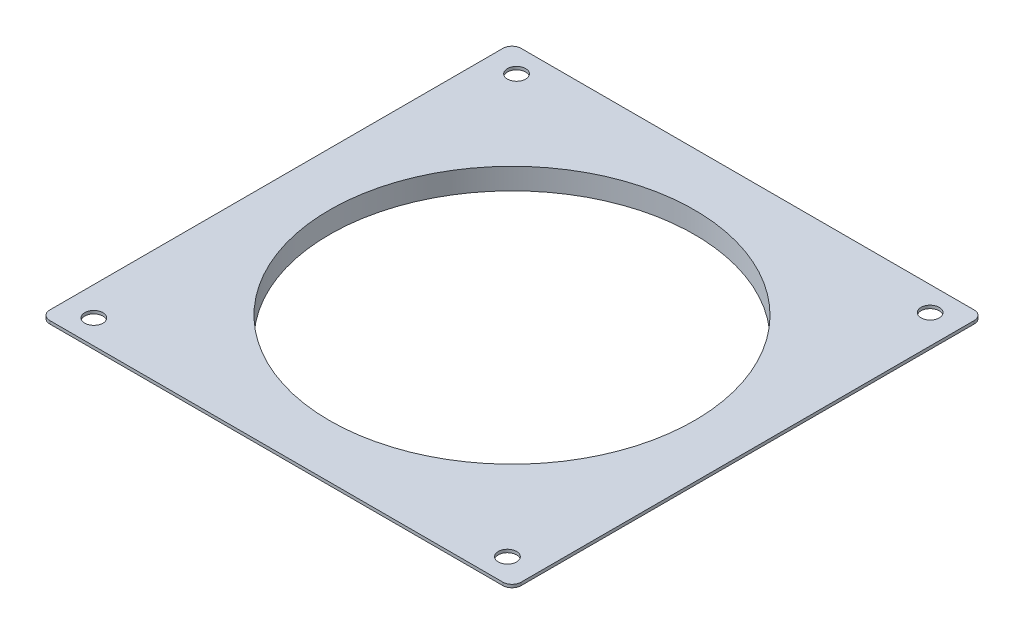
ISO-10303-21;
HEADER;
FILE_DESCRIPTION(('STEP AP214'),'2;1');
FILE_NAME('part.step','',(''),(''),'','','');
FILE_SCHEMA(('AUTOMOTIVE_DESIGN { 1 0 10303 214 1 1 1 1 }'));
ENDSEC;
DATA;
#1=APPLICATION_CONTEXT('core data for automotive mechanical design processes');
#2=APPLICATION_PROTOCOL_DEFINITION('international standard','automotive_design',2000,#1);
#3=PRODUCT_CONTEXT('',#1,'mechanical');
#4=PRODUCT('Part','Part','',(#3));
#5=PRODUCT_RELATED_PRODUCT_CATEGORY('part','',(#4));
#6=PRODUCT_DEFINITION_FORMATION('','',#4);
#7=PRODUCT_DEFINITION_CONTEXT('part definition',#1,'design');
#8=PRODUCT_DEFINITION('design','',#6,#7);
#9=PRODUCT_DEFINITION_SHAPE('','',#8);
#10=(LENGTH_UNIT() NAMED_UNIT(*) SI_UNIT(.MILLI.,.METRE.));
#11=(NAMED_UNIT(*) PLANE_ANGLE_UNIT() SI_UNIT($,.RADIAN.));
#12=(NAMED_UNIT(*) SI_UNIT($,.STERADIAN.) SOLID_ANGLE_UNIT());
#13=UNCERTAINTY_MEASURE_WITH_UNIT(LENGTH_MEASURE(1.E-05),#10,'distance_accuracy_value','');
#14=(GEOMETRIC_REPRESENTATION_CONTEXT(3) GLOBAL_UNCERTAINTY_ASSIGNED_CONTEXT((#13)) GLOBAL_UNIT_ASSIGNED_CONTEXT((#10,
#11,#12)) REPRESENTATION_CONTEXT('',''));
#15=CARTESIAN_POINT('',(0.,0.,0.));
#16=DIRECTION('',(0.,0.,1.));
#17=DIRECTION('',(1.,0.,0.));
#18=AXIS2_PLACEMENT_3D('',#15,#16,#17);
#19=CARTESIAN_POINT('',(77.5,1.,0.));
#20=DIRECTION('',(1.,0.,0.));
#21=DIRECTION('',(0.,0.,-1.));
#22=AXIS2_PLACEMENT_3D('',#19,#20,#21);
#23=PLANE('',#22);
#24=DIRECTION('',(0.,0.,1.));
#25=VECTOR('',#24,1.);
#26=CARTESIAN_POINT('',(77.5,0.,0.));
#27=LINE('',#26,#25);
#28=CARTESIAN_POINT('',(77.5,0.,-74.5));
#29=VERTEX_POINT('',#28);
#30=CARTESIAN_POINT('',(77.5,0.,74.5));
#31=VERTEX_POINT('',#30);
#32=EDGE_CURVE('E141',#29,#31,#27,.T.);
#33=ORIENTED_EDGE('',*,*,#32,.F.);
#34=DIRECTION('',(0.,-1.,0.));
#35=VECTOR('',#34,1.);
#36=CARTESIAN_POINT('',(77.5,1.,-74.5));
#37=LINE('',#36,#35);
#38=CARTESIAN_POINT('',(77.5,1.,-74.5));
#39=VERTEX_POINT('',#38);
#40=EDGE_CURVE('E167',#29,#39,#37,.F.);
#41=ORIENTED_EDGE('',*,*,#40,.T.);
#42=DIRECTION('',(0.,0.,1.));
#43=VECTOR('',#42,1.);
#44=CARTESIAN_POINT('',(77.5,1.,0.));
#45=LINE('',#44,#43);
#46=CARTESIAN_POINT('',(77.5,1.,74.5));
#47=VERTEX_POINT('',#46);
#48=EDGE_CURVE('E184',#39,#47,#45,.T.);
#49=ORIENTED_EDGE('',*,*,#48,.T.);
#50=DIRECTION('',(0.,-1.,0.));
#51=VECTOR('',#50,1.);
#52=CARTESIAN_POINT('',(77.5,0.,74.5));
#53=LINE('',#52,#51);
#54=EDGE_CURVE('E164',#47,#31,#53,.T.);
#55=ORIENTED_EDGE('',*,*,#54,.T.);
#56=EDGE_LOOP('',(#33,#41,#49,#55));
#57=FACE_BOUND('',#56,.T.);
#58=ADVANCED_FACE('F44',(#57),#23,.T.);
#59=CARTESIAN_POINT('',(0.,1.,-77.5));
#60=DIRECTION('',(0.,0.,-1.));
#61=DIRECTION('',(-1.,0.,0.));
#62=AXIS2_PLACEMENT_3D('',#59,#60,#61);
#63=PLANE('',#62);
#64=DIRECTION('',(1.,0.,0.));
#65=VECTOR('',#64,1.);
#66=CARTESIAN_POINT('',(0.,0.,-77.5));
#67=LINE('',#66,#65);
#68=CARTESIAN_POINT('',(-74.5,0.,-77.5));
#69=VERTEX_POINT('',#68);
#70=CARTESIAN_POINT('',(74.5,0.,-77.5));
#71=VERTEX_POINT('',#70);
#72=EDGE_CURVE('E137',#69,#71,#67,.T.);
#73=ORIENTED_EDGE('',*,*,#72,.F.);
#74=DIRECTION('',(0.,-1.,0.));
#75=VECTOR('',#74,1.);
#76=CARTESIAN_POINT('',(-74.5,1.,-77.5));
#77=LINE('',#76,#75);
#78=CARTESIAN_POINT('',(-74.5,1.,-77.5));
#79=VERTEX_POINT('',#78);
#80=EDGE_CURVE('E115',#69,#79,#77,.F.);
#81=ORIENTED_EDGE('',*,*,#80,.T.);
#82=DIRECTION('',(1.,0.,0.));
#83=VECTOR('',#82,1.);
#84=CARTESIAN_POINT('',(0.,1.,-77.5));
#85=LINE('',#84,#83);
#86=CARTESIAN_POINT('',(74.5,1.,-77.5));
#87=VERTEX_POINT('',#86);
#88=EDGE_CURVE('E186',#79,#87,#85,.T.);
#89=ORIENTED_EDGE('',*,*,#88,.T.);
#90=DIRECTION('',(0.,-1.,0.));
#91=VECTOR('',#90,1.);
#92=CARTESIAN_POINT('',(74.5,1.,-77.5));
#93=LINE('',#92,#91);
#94=EDGE_CURVE('E120',#87,#71,#93,.T.);
#95=ORIENTED_EDGE('',*,*,#94,.T.);
#96=EDGE_LOOP('',(#73,#81,#89,#95));
#97=FACE_BOUND('',#96,.T.);
#98=ADVANCED_FACE('F226',(#97),#63,.T.);
#99=CARTESIAN_POINT('',(-77.5,1.,0.));
#100=DIRECTION('',(1.,0.,0.));
#101=DIRECTION('',(0.,0.,-1.));
#102=AXIS2_PLACEMENT_3D('',#99,#100,#101);
#103=PLANE('',#102);
#104=DIRECTION('',(0.,0.,1.));
#105=VECTOR('',#104,1.);
#106=CARTESIAN_POINT('',(-77.5,1.,0.));
#107=LINE('',#106,#105);
#108=CARTESIAN_POINT('',(-77.5,1.,-74.5));
#109=VERTEX_POINT('',#108);
#110=CARTESIAN_POINT('',(-77.5,1.,74.5));
#111=VERTEX_POINT('',#110);
#112=EDGE_CURVE('E129',#109,#111,#107,.T.);
#113=ORIENTED_EDGE('',*,*,#112,.F.);
#114=DIRECTION('',(0.,-1.,0.));
#115=VECTOR('',#114,1.);
#116=CARTESIAN_POINT('',(-77.5,0.,-74.5));
#117=LINE('',#116,#115);
#118=CARTESIAN_POINT('',(-77.5,0.,-74.5));
#119=VERTEX_POINT('',#118);
#120=EDGE_CURVE('E114',#109,#119,#117,.T.);
#121=ORIENTED_EDGE('',*,*,#120,.T.);
#122=DIRECTION('',(0.,0.,1.));
#123=VECTOR('',#122,1.);
#124=CARTESIAN_POINT('',(-77.5,0.,0.));
#125=LINE('',#124,#123);
#126=CARTESIAN_POINT('',(-77.5,0.,74.5));
#127=VERTEX_POINT('',#126);
#128=EDGE_CURVE('E127',#119,#127,#125,.T.);
#129=ORIENTED_EDGE('',*,*,#128,.T.);
#130=DIRECTION('',(0.,-1.,0.));
#131=VECTOR('',#130,1.);
#132=CARTESIAN_POINT('',(-77.5,1.,74.5));
#133=LINE('',#132,#131);
#134=EDGE_CURVE('E131',#127,#111,#133,.F.);
#135=ORIENTED_EDGE('',*,*,#134,.T.);
#136=EDGE_LOOP('',(#113,#121,#129,#135));
#137=FACE_BOUND('',#136,.T.);
#138=ADVANCED_FACE('F126',(#137),#103,.F.);
#139=CARTESIAN_POINT('',(0.,1.,77.5));
#140=DIRECTION('',(0.,0.,-1.));
#141=DIRECTION('',(-1.,0.,0.));
#142=AXIS2_PLACEMENT_3D('',#139,#140,#141);
#143=PLANE('',#142);
#144=DIRECTION('',(1.,0.,0.));
#145=VECTOR('',#144,1.);
#146=CARTESIAN_POINT('',(0.,0.,77.5));
#147=LINE('',#146,#145);
#148=CARTESIAN_POINT('',(-74.5,0.,77.5));
#149=VERTEX_POINT('',#148);
#150=CARTESIAN_POINT('',(74.5,0.,77.5));
#151=VERTEX_POINT('',#150);
#152=EDGE_CURVE('E136',#149,#151,#147,.T.);
#153=ORIENTED_EDGE('',*,*,#152,.T.);
#154=DIRECTION('',(0.,-1.,0.));
#155=VECTOR('',#154,1.);
#156=CARTESIAN_POINT('',(74.5,1.,77.5));
#157=LINE('',#156,#155);
#158=CARTESIAN_POINT('',(74.5,1.,77.5));
#159=VERTEX_POINT('',#158);
#160=EDGE_CURVE('E11',#151,#159,#157,.F.);
#161=ORIENTED_EDGE('',*,*,#160,.T.);
#162=DIRECTION('',(1.,0.,0.));
#163=VECTOR('',#162,1.);
#164=CARTESIAN_POINT('',(0.,1.,77.5));
#165=LINE('',#164,#163);
#166=CARTESIAN_POINT('',(-74.5,1.,77.5));
#167=VERTEX_POINT('',#166);
#168=EDGE_CURVE('E172',#167,#159,#165,.T.);
#169=ORIENTED_EDGE('',*,*,#168,.F.);
#170=DIRECTION('',(0.,-1.,0.));
#171=VECTOR('',#170,1.);
#172=CARTESIAN_POINT('',(-74.5,1.,77.5));
#173=LINE('',#172,#171);
#174=EDGE_CURVE('E53',#167,#149,#173,.T.);
#175=ORIENTED_EDGE('',*,*,#174,.T.);
#176=EDGE_LOOP('',(#153,#161,#169,#175));
#177=FACE_BOUND('',#176,.T.);
#178=ADVANCED_FACE('F171',(#177),#143,.F.);
#179=CARTESIAN_POINT('',(-68.,1.,-69.5));
#180=DIRECTION('',(0.,-1.,0.));
#181=DIRECTION('',(0.,0.,-1.));
#182=AXIS2_PLACEMENT_3D('',#179,#180,#181);
#183=CYLINDRICAL_SURFACE('',#182,3.00000000000001);
#184=CARTESIAN_POINT('',(-68.,1.,-69.5));
#185=DIRECTION('',(0.,1.,0.));
#186=DIRECTION('',(0.,0.,1.));
#187=AXIS2_PLACEMENT_3D('',#184,#185,#186);
#188=CIRCLE('',#187,3.00000000000001);
#189=CARTESIAN_POINT('',(-68.,1.,-66.5));
#190=VERTEX_POINT('',#189);
#191=EDGE_CURVE('E187',#190,#190,#188,.T.);
#192=ORIENTED_EDGE('',*,*,#191,.T.);
#193=EDGE_LOOP('',(#192));
#194=FACE_BOUND('',#193,.T.);
#195=CARTESIAN_POINT('',(-68.,0.,-69.5));
#196=DIRECTION('',(0.,1.,0.));
#197=DIRECTION('',(0.,0.,1.));
#198=AXIS2_PLACEMENT_3D('',#195,#196,#197);
#199=CIRCLE('',#198,3.00000000000001);
#200=CARTESIAN_POINT('',(-68.,0.,-66.5));
#201=VERTEX_POINT('',#200);
#202=EDGE_CURVE('E206',#201,#201,#199,.T.);
#203=ORIENTED_EDGE('',*,*,#202,.F.);
#204=EDGE_LOOP('',(#203));
#205=FACE_BOUND('',#204,.T.);
#206=ADVANCED_FACE('F211',(#194,#205),#183,.F.);
#207=CARTESIAN_POINT('',(68.,1.,-69.5));
#208=DIRECTION('',(0.,-1.,0.));
#209=DIRECTION('',(0.,0.,-1.));
#210=AXIS2_PLACEMENT_3D('',#207,#208,#209);
#211=CYLINDRICAL_SURFACE('',#210,3.00000000000001);
#212=CARTESIAN_POINT('',(68.,1.,-69.5));
#213=DIRECTION('',(0.,1.,0.));
#214=DIRECTION('',(0.,0.,1.));
#215=AXIS2_PLACEMENT_3D('',#212,#213,#214);
#216=CIRCLE('',#215,3.00000000000001);
#217=CARTESIAN_POINT('',(68.,1.,-66.5));
#218=VERTEX_POINT('',#217);
#219=EDGE_CURVE('E192',#218,#218,#216,.T.);
#220=ORIENTED_EDGE('',*,*,#219,.T.);
#221=EDGE_LOOP('',(#220));
#222=FACE_BOUND('',#221,.T.);
#223=CARTESIAN_POINT('',(68.,0.,-69.5));
#224=DIRECTION('',(0.,1.,0.));
#225=DIRECTION('',(0.,0.,1.));
#226=AXIS2_PLACEMENT_3D('',#223,#224,#225);
#227=CIRCLE('',#226,3.00000000000001);
#228=CARTESIAN_POINT('',(68.,0.,-66.5));
#229=VERTEX_POINT('',#228);
#230=EDGE_CURVE('E203',#229,#229,#227,.T.);
#231=ORIENTED_EDGE('',*,*,#230,.F.);
#232=EDGE_LOOP('',(#231));
#233=FACE_BOUND('',#232,.T.);
#234=ADVANCED_FACE('F213',(#222,#233),#211,.F.);
#235=CARTESIAN_POINT('',(-68.,1.,69.5));
#236=DIRECTION('',(0.,-1.,0.));
#237=DIRECTION('',(0.,0.,-1.));
#238=AXIS2_PLACEMENT_3D('',#235,#236,#237);
#239=CYLINDRICAL_SURFACE('',#238,3.00000000000001);
#240=CARTESIAN_POINT('',(-68.,1.,69.5));
#241=DIRECTION('',(0.,1.,0.));
#242=DIRECTION('',(0.,0.,1.));
#243=AXIS2_PLACEMENT_3D('',#240,#241,#242);
#244=CIRCLE('',#243,3.00000000000001);
#245=CARTESIAN_POINT('',(-68.,1.,72.5));
#246=VERTEX_POINT('',#245);
#247=EDGE_CURVE('E269',#246,#246,#244,.F.);
#248=ORIENTED_EDGE('',*,*,#247,.F.);
#249=EDGE_LOOP('',(#248));
#250=FACE_BOUND('',#249,.T.);
#251=CARTESIAN_POINT('',(-68.,0.,69.5));
#252=DIRECTION('',(0.,1.,0.));
#253=DIRECTION('',(0.,0.,1.));
#254=AXIS2_PLACEMENT_3D('',#251,#252,#253);
#255=CIRCLE('',#254,3.00000000000001);
#256=CARTESIAN_POINT('',(-68.,0.,72.5));
#257=VERTEX_POINT('',#256);
#258=EDGE_CURVE('E200',#257,#257,#255,.F.);
#259=ORIENTED_EDGE('',*,*,#258,.T.);
#260=EDGE_LOOP('',(#259));
#261=FACE_BOUND('',#260,.T.);
#262=ADVANCED_FACE('F220',(#250,#261),#239,.F.);
#263=CARTESIAN_POINT('',(0.,1.,0.));
#264=DIRECTION('',(0.,-1.,0.));
#265=DIRECTION('',(0.,0.,-1.));
#266=AXIS2_PLACEMENT_3D('',#263,#264,#265);
#267=CYLINDRICAL_SURFACE('',#266,60.);
#268=CARTESIAN_POINT('',(0.,1.,0.));
#269=DIRECTION('',(0.,1.,0.));
#270=DIRECTION('',(0.,0.,1.));
#271=AXIS2_PLACEMENT_3D('',#268,#269,#270);
#272=CIRCLE('',#271,60.);
#273=CARTESIAN_POINT('',(0.,1.,60.));
#274=VERTEX_POINT('',#273);
#275=EDGE_CURVE('E147',#274,#274,#272,.T.);
#276=ORIENTED_EDGE('',*,*,#275,.T.);
#277=EDGE_LOOP('',(#276));
#278=FACE_BOUND('',#277,.T.);
#279=CARTESIAN_POINT('',(0.,-6.,0.));
#280=DIRECTION('',(0.,1.,0.));
#281=DIRECTION('',(0.,0.,1.));
#282=AXIS2_PLACEMENT_3D('',#279,#280,#281);
#283=CIRCLE('',#282,60.);
#284=CARTESIAN_POINT('',(0.,-6.,60.));
#285=VERTEX_POINT('',#284);
#286=EDGE_CURVE('E259',#285,#285,#283,.T.);
#287=ORIENTED_EDGE('',*,*,#286,.F.);
#288=EDGE_LOOP('',(#287));
#289=FACE_BOUND('',#288,.T.);
#290=ADVANCED_FACE('F239',(#278,#289),#267,.F.);
#291=CARTESIAN_POINT('',(68.,1.,69.5));
#292=DIRECTION('',(0.,-1.,0.));
#293=DIRECTION('',(0.,0.,-1.));
#294=AXIS2_PLACEMENT_3D('',#291,#292,#293);
#295=CYLINDRICAL_SURFACE('',#294,3.00000000000001);
#296=CARTESIAN_POINT('',(68.,1.,69.5));
#297=DIRECTION('',(0.,1.,0.));
#298=DIRECTION('',(0.,0.,1.));
#299=AXIS2_PLACEMENT_3D('',#296,#297,#298);
#300=CIRCLE('',#299,3.00000000000001);
#301=CARTESIAN_POINT('',(68.,1.,72.5));
#302=VERTEX_POINT('',#301);
#303=EDGE_CURVE('E148',#302,#302,#300,.F.);
#304=ORIENTED_EDGE('',*,*,#303,.F.);
#305=EDGE_LOOP('',(#304));
#306=FACE_BOUND('',#305,.T.);
#307=CARTESIAN_POINT('',(68.,0.,69.5));
#308=DIRECTION('',(0.,1.,0.));
#309=DIRECTION('',(0.,0.,1.));
#310=AXIS2_PLACEMENT_3D('',#307,#308,#309);
#311=CIRCLE('',#310,3.00000000000001);
#312=CARTESIAN_POINT('',(68.,0.,72.5));
#313=VERTEX_POINT('',#312);
#314=EDGE_CURVE('E139',#313,#313,#311,.F.);
#315=ORIENTED_EDGE('',*,*,#314,.T.);
#316=EDGE_LOOP('',(#315));
#317=FACE_BOUND('',#316,.T.);
#318=ADVANCED_FACE('F235',(#306,#317),#295,.F.);
#319=CARTESIAN_POINT('',(0.,1.,0.));
#320=DIRECTION('',(0.,1.,0.));
#321=DIRECTION('',(0.,0.,1.));
#322=AXIS2_PLACEMENT_3D('',#319,#320,#321);
#323=PLANE('',#322);
#324=ORIENTED_EDGE('',*,*,#247,.T.);
#325=EDGE_LOOP('',(#324));
#326=FACE_BOUND('',#325,.T.);
#327=ORIENTED_EDGE('',*,*,#219,.F.);
#328=EDGE_LOOP('',(#327));
#329=FACE_BOUND('',#328,.T.);
#330=ORIENTED_EDGE('',*,*,#191,.F.);
#331=EDGE_LOOP('',(#330));
#332=FACE_BOUND('',#331,.T.);
#333=ORIENTED_EDGE('',*,*,#88,.F.);
#334=CARTESIAN_POINT('',(-74.5,1.,-74.5));
#335=DIRECTION('',(0.,1.,0.));
#336=DIRECTION('',(0.,0.,1.));
#337=AXIS2_PLACEMENT_3D('',#334,#335,#336);
#338=CIRCLE('',#337,3.);
#339=EDGE_CURVE('E162',#79,#109,#338,.T.);
#340=ORIENTED_EDGE('',*,*,#339,.T.);
#341=ORIENTED_EDGE('',*,*,#112,.T.);
#342=CARTESIAN_POINT('',(-74.5,1.,74.5));
#343=DIRECTION('',(0.,1.,0.));
#344=DIRECTION('',(0.,0.,1.));
#345=AXIS2_PLACEMENT_3D('',#342,#343,#344);
#346=CIRCLE('',#345,3.);
#347=EDGE_CURVE('E65',#111,#167,#346,.T.);
#348=ORIENTED_EDGE('',*,*,#347,.T.);
#349=ORIENTED_EDGE('',*,*,#168,.T.);
#350=CARTESIAN_POINT('',(74.5,1.,74.5));
#351=DIRECTION('',(0.,1.,0.));
#352=DIRECTION('',(0.,0.,1.));
#353=AXIS2_PLACEMENT_3D('',#350,#351,#352);
#354=CIRCLE('',#353,3.);
#355=EDGE_CURVE('E158',#159,#47,#354,.T.);
#356=ORIENTED_EDGE('',*,*,#355,.T.);
#357=ORIENTED_EDGE('',*,*,#48,.F.);
#358=CARTESIAN_POINT('',(74.5,1.,-74.5));
#359=DIRECTION('',(0.,1.,0.));
#360=DIRECTION('',(0.,0.,1.));
#361=AXIS2_PLACEMENT_3D('',#358,#359,#360);
#362=CIRCLE('',#361,3.);
#363=EDGE_CURVE('E160',#39,#87,#362,.T.);
#364=ORIENTED_EDGE('',*,*,#363,.T.);
#365=EDGE_LOOP('',(#333,#340,#341,#348,#349,#356,#357,#364));
#366=FACE_BOUND('',#365,.T.);
#367=ORIENTED_EDGE('',*,*,#303,.T.);
#368=EDGE_LOOP('',(#367));
#369=FACE_BOUND('',#368,.T.);
#370=ORIENTED_EDGE('',*,*,#275,.F.);
#371=EDGE_LOOP('',(#370));
#372=FACE_BOUND('',#371,.T.);
#373=ADVANCED_FACE('F238',(#326,#329,#332,#366,#369,#372),#323,.T.);
#374=CARTESIAN_POINT('',(0.,0.,0.));
#375=DIRECTION('',(0.,1.,0.));
#376=DIRECTION('',(0.,0.,1.));
#377=AXIS2_PLACEMENT_3D('',#374,#375,#376);
#378=PLANE('',#377);
#379=CARTESIAN_POINT('',(0.,0.,0.));
#380=DIRECTION('',(0.,1.,0.));
#381=DIRECTION('',(0.,0.,1.));
#382=AXIS2_PLACEMENT_3D('',#379,#380,#381);
#383=CIRCLE('',#382,65.);
#384=CARTESIAN_POINT('',(0.,0.,65.));
#385=VERTEX_POINT('',#384);
#386=EDGE_CURVE('E48',#385,#385,#383,.T.);
#387=ORIENTED_EDGE('',*,*,#386,.T.);
#388=EDGE_LOOP('',(#387));
#389=FACE_BOUND('',#388,.T.);
#390=ORIENTED_EDGE('',*,*,#258,.F.);
#391=EDGE_LOOP('',(#390));
#392=FACE_BOUND('',#391,.T.);
#393=ORIENTED_EDGE('',*,*,#230,.T.);
#394=EDGE_LOOP('',(#393));
#395=FACE_BOUND('',#394,.T.);
#396=ORIENTED_EDGE('',*,*,#202,.T.);
#397=EDGE_LOOP('',(#396));
#398=FACE_BOUND('',#397,.T.);
#399=ORIENTED_EDGE('',*,*,#128,.F.);
#400=CARTESIAN_POINT('',(-74.5,0.,-74.5));
#401=DIRECTION('',(0.,1.,0.));
#402=DIRECTION('',(0.,0.,1.));
#403=AXIS2_PLACEMENT_3D('',#400,#401,#402);
#404=CIRCLE('',#403,3.);
#405=EDGE_CURVE('E110',#119,#69,#404,.F.);
#406=ORIENTED_EDGE('',*,*,#405,.T.);
#407=ORIENTED_EDGE('',*,*,#72,.T.);
#408=CARTESIAN_POINT('',(74.5,0.,-74.5));
#409=DIRECTION('',(0.,1.,0.));
#410=DIRECTION('',(0.,0.,1.));
#411=AXIS2_PLACEMENT_3D('',#408,#409,#410);
#412=CIRCLE('',#411,3.);
#413=EDGE_CURVE('E121',#71,#29,#412,.F.);
#414=ORIENTED_EDGE('',*,*,#413,.T.);
#415=ORIENTED_EDGE('',*,*,#32,.T.);
#416=CARTESIAN_POINT('',(74.5,0.,74.5));
#417=DIRECTION('',(0.,1.,0.));
#418=DIRECTION('',(0.,0.,1.));
#419=AXIS2_PLACEMENT_3D('',#416,#417,#418);
#420=CIRCLE('',#419,3.);
#421=EDGE_CURVE('E151',#31,#151,#420,.F.);
#422=ORIENTED_EDGE('',*,*,#421,.T.);
#423=ORIENTED_EDGE('',*,*,#152,.F.);
#424=CARTESIAN_POINT('',(-74.5,0.,74.5));
#425=DIRECTION('',(0.,1.,0.));
#426=DIRECTION('',(0.,0.,1.));
#427=AXIS2_PLACEMENT_3D('',#424,#425,#426);
#428=CIRCLE('',#427,3.);
#429=EDGE_CURVE('E130',#149,#127,#428,.F.);
#430=ORIENTED_EDGE('',*,*,#429,.T.);
#431=EDGE_LOOP('',(#399,#406,#407,#414,#415,#422,#423,#430));
#432=FACE_BOUND('',#431,.T.);
#433=ORIENTED_EDGE('',*,*,#314,.F.);
#434=EDGE_LOOP('',(#433));
#435=FACE_BOUND('',#434,.T.);
#436=ADVANCED_FACE('F133',(#389,#392,#395,#398,#432,#435),#378,.F.);
#437=CARTESIAN_POINT('',(-74.5,1.,-74.5));
#438=DIRECTION('',(0.,1.,0.));
#439=DIRECTION('',(0.,0.,1.));
#440=AXIS2_PLACEMENT_3D('',#437,#438,#439);
#441=CYLINDRICAL_SURFACE('',#440,3.);
#442=ORIENTED_EDGE('',*,*,#339,.F.);
#443=ORIENTED_EDGE('',*,*,#80,.F.);
#444=ORIENTED_EDGE('',*,*,#405,.F.);
#445=ORIENTED_EDGE('',*,*,#120,.F.);
#446=EDGE_LOOP('',(#442,#443,#444,#445));
#447=FACE_BOUND('',#446,.T.);
#448=ADVANCED_FACE('F113',(#447),#441,.T.);
#449=CARTESIAN_POINT('',(74.5,1.,-74.5));
#450=DIRECTION('',(0.,-1.,0.));
#451=DIRECTION('',(0.,0.,-1.));
#452=AXIS2_PLACEMENT_3D('',#449,#450,#451);
#453=CYLINDRICAL_SURFACE('',#452,3.);
#454=ORIENTED_EDGE('',*,*,#363,.F.);
#455=ORIENTED_EDGE('',*,*,#40,.F.);
#456=ORIENTED_EDGE('',*,*,#413,.F.);
#457=ORIENTED_EDGE('',*,*,#94,.F.);
#458=EDGE_LOOP('',(#454,#455,#456,#457));
#459=FACE_BOUND('',#458,.T.);
#460=ADVANCED_FACE('F294',(#459),#453,.T.);
#461=CARTESIAN_POINT('',(74.5,1.,74.5));
#462=DIRECTION('',(0.,1.,0.));
#463=DIRECTION('',(0.,0.,1.));
#464=AXIS2_PLACEMENT_3D('',#461,#462,#463);
#465=CYLINDRICAL_SURFACE('',#464,3.);
#466=ORIENTED_EDGE('',*,*,#355,.F.);
#467=ORIENTED_EDGE('',*,*,#160,.F.);
#468=ORIENTED_EDGE('',*,*,#421,.F.);
#469=ORIENTED_EDGE('',*,*,#54,.F.);
#470=EDGE_LOOP('',(#466,#467,#468,#469));
#471=FACE_BOUND('',#470,.T.);
#472=ADVANCED_FACE('F179',(#471),#465,.T.);
#473=CARTESIAN_POINT('',(-74.5,1.,74.5));
#474=DIRECTION('',(0.,-1.,0.));
#475=DIRECTION('',(0.,0.,-1.));
#476=AXIS2_PLACEMENT_3D('',#473,#474,#475);
#477=CYLINDRICAL_SURFACE('',#476,3.);
#478=ORIENTED_EDGE('',*,*,#347,.F.);
#479=ORIENTED_EDGE('',*,*,#134,.F.);
#480=ORIENTED_EDGE('',*,*,#429,.F.);
#481=ORIENTED_EDGE('',*,*,#174,.F.);
#482=EDGE_LOOP('',(#478,#479,#480,#481));
#483=FACE_BOUND('',#482,.T.);
#484=ADVANCED_FACE('F46',(#483),#477,.T.);
#485=CARTESIAN_POINT('',(0.,-6.,0.));
#486=DIRECTION('',(0.,1.,0.));
#487=DIRECTION('',(0.,0.,1.));
#488=AXIS2_PLACEMENT_3D('',#485,#486,#487);
#489=CYLINDRICAL_SURFACE('',#488,65.);
#490=CARTESIAN_POINT('',(0.,-6.,0.));
#491=DIRECTION('',(0.,1.,0.));
#492=DIRECTION('',(0.,0.,1.));
#493=AXIS2_PLACEMENT_3D('',#490,#491,#492);
#494=CIRCLE('',#493,65.);
#495=CARTESIAN_POINT('',(0.,-6.,65.));
#496=VERTEX_POINT('',#495);
#497=EDGE_CURVE('E262',#496,#496,#494,.T.);
#498=ORIENTED_EDGE('',*,*,#497,.T.);
#499=EDGE_LOOP('',(#498));
#500=FACE_BOUND('',#499,.T.);
#501=ORIENTED_EDGE('',*,*,#386,.F.);
#502=EDGE_LOOP('',(#501));
#503=FACE_BOUND('',#502,.T.);
#504=ADVANCED_FACE('F247',(#500,#503),#489,.T.);
#505=CARTESIAN_POINT('',(0.,-6.,0.));
#506=DIRECTION('',(0.,1.,0.));
#507=DIRECTION('',(0.,0.,1.));
#508=AXIS2_PLACEMENT_3D('',#505,#506,#507);
#509=PLANE('',#508);
#510=ORIENTED_EDGE('',*,*,#286,.T.);
#511=EDGE_LOOP('',(#510));
#512=FACE_BOUND('',#511,.T.);
#513=ORIENTED_EDGE('',*,*,#497,.F.);
#514=EDGE_LOOP('',(#513));
#515=FACE_BOUND('',#514,.T.);
#516=ADVANCED_FACE('F250',(#512,#515),#509,.F.);
#517=CLOSED_SHELL('',(#58,#98,#138,#178,#206,#234,#262,#290,#318,#373,#436,#448,#460,#472,#484,
#504,#516));
#518=MANIFOLD_SOLID_BREP('B2',#517);
#519=ADVANCED_BREP_SHAPE_REPRESENTATION('',(#18,#518),#14);
#520=SHAPE_DEFINITION_REPRESENTATION(#9,#519);
ENDSEC;
END-ISO-10303-21;
